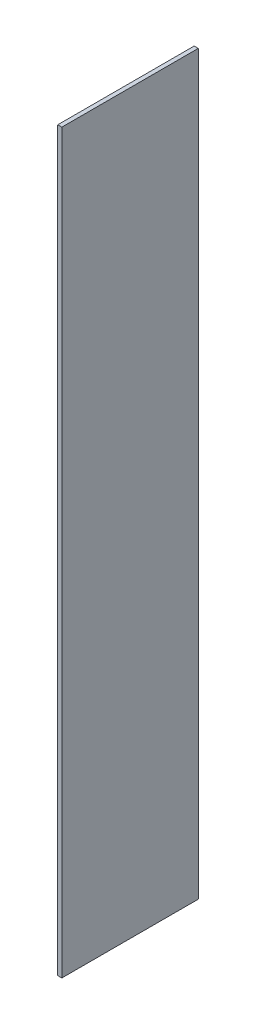
ISO-10303-21;
HEADER;
FILE_DESCRIPTION(('STEP AP214'),'2;1');
FILE_NAME('part.step','',(''),(''),'','','');
FILE_SCHEMA(('AUTOMOTIVE_DESIGN { 1 0 10303 214 1 1 1 1 }'));
ENDSEC;
DATA;
#1=APPLICATION_CONTEXT('core data for automotive mechanical design processes');
#2=APPLICATION_PROTOCOL_DEFINITION('international standard','automotive_design',2000,#1);
#3=PRODUCT_CONTEXT('',#1,'mechanical');
#4=PRODUCT('Part','Part','',(#3));
#5=PRODUCT_RELATED_PRODUCT_CATEGORY('part','',(#4));
#6=PRODUCT_DEFINITION_FORMATION('','',#4);
#7=PRODUCT_DEFINITION_CONTEXT('part definition',#1,'design');
#8=PRODUCT_DEFINITION('design','',#6,#7);
#9=PRODUCT_DEFINITION_SHAPE('','',#8);
#10=(LENGTH_UNIT() NAMED_UNIT(*) SI_UNIT(.MILLI.,.METRE.));
#11=(NAMED_UNIT(*) PLANE_ANGLE_UNIT() SI_UNIT($,.RADIAN.));
#12=(NAMED_UNIT(*) SI_UNIT($,.STERADIAN.) SOLID_ANGLE_UNIT());
#13=UNCERTAINTY_MEASURE_WITH_UNIT(LENGTH_MEASURE(1.E-05),#10,'distance_accuracy_value','');
#14=(GEOMETRIC_REPRESENTATION_CONTEXT(3) GLOBAL_UNCERTAINTY_ASSIGNED_CONTEXT((#13)) GLOBAL_UNIT_ASSIGNED_CONTEXT((#10,
#11,#12)) REPRESENTATION_CONTEXT('',''));
#15=CARTESIAN_POINT('',(0.,0.,0.));
#16=DIRECTION('',(0.,0.,1.));
#17=DIRECTION('',(1.,0.,0.));
#18=AXIS2_PLACEMENT_3D('',#15,#16,#17);
#19=CARTESIAN_POINT('',(0.749999999999997,135.,-25.));
#20=DIRECTION('',(-1.,0.,0.));
#21=DIRECTION('',(0.,0.,1.));
#22=AXIS2_PLACEMENT_3D('',#19,#20,#21);
#23=PLANE('',#22);
#24=DIRECTION('',(0.,0.,-1.));
#25=VECTOR('',#24,1.);
#26=CARTESIAN_POINT('',(0.749999999999997,-135.,-25.));
#27=LINE('',#26,#25);
#28=CARTESIAN_POINT('',(0.750000000000002,-135.,25.));
#29=VERTEX_POINT('',#28);
#30=CARTESIAN_POINT('',(0.749999999999997,-135.,-25.));
#31=VERTEX_POINT('',#30);
#32=EDGE_CURVE('E96',#29,#31,#27,.T.);
#33=ORIENTED_EDGE('',*,*,#32,.T.);
#34=DIRECTION('',(0.,-1.,0.));
#35=VECTOR('',#34,1.);
#36=CARTESIAN_POINT('',(0.749999999999997,135.,-25.));
#37=LINE('',#36,#35);
#38=CARTESIAN_POINT('',(0.749999999999997,135.,-25.));
#39=VERTEX_POINT('',#38);
#40=EDGE_CURVE('E11',#39,#31,#37,.T.);
#41=ORIENTED_EDGE('',*,*,#40,.F.);
#42=DIRECTION('',(0.,0.,-1.));
#43=VECTOR('',#42,1.);
#44=CARTESIAN_POINT('',(0.749999999999997,135.,-25.));
#45=LINE('',#44,#43);
#46=CARTESIAN_POINT('',(0.750000000000002,135.,25.));
#47=VERTEX_POINT('',#46);
#48=EDGE_CURVE('E84',#47,#39,#45,.T.);
#49=ORIENTED_EDGE('',*,*,#48,.F.);
#50=DIRECTION('',(0.,-1.,0.));
#51=VECTOR('',#50,1.);
#52=CARTESIAN_POINT('',(0.750000000000002,135.,25.));
#53=LINE('',#52,#51);
#54=EDGE_CURVE('E92',#47,#29,#53,.T.);
#55=ORIENTED_EDGE('',*,*,#54,.T.);
#56=EDGE_LOOP('',(#33,#41,#49,#55));
#57=FACE_BOUND('',#56,.T.);
#58=ADVANCED_FACE('F33',(#57),#23,.F.);
#59=CARTESIAN_POINT('',(-0.750000000000002,135.,-25.));
#60=DIRECTION('',(0.,0.,1.));
#61=DIRECTION('',(1.,0.,0.));
#62=AXIS2_PLACEMENT_3D('',#59,#60,#61);
#63=PLANE('',#62);
#64=DIRECTION('',(-1.,0.,0.));
#65=VECTOR('',#64,1.);
#66=CARTESIAN_POINT('',(-0.750000000000002,-135.,-25.));
#67=LINE('',#66,#65);
#68=CARTESIAN_POINT('',(-0.750000000000002,-135.,-25.));
#69=VERTEX_POINT('',#68);
#70=EDGE_CURVE('E88',#31,#69,#67,.T.);
#71=ORIENTED_EDGE('',*,*,#70,.T.);
#72=DIRECTION('',(0.,-1.,0.));
#73=VECTOR('',#72,1.);
#74=CARTESIAN_POINT('',(-0.750000000000002,135.,-25.));
#75=LINE('',#74,#73);
#76=CARTESIAN_POINT('',(-0.750000000000002,135.,-25.));
#77=VERTEX_POINT('',#76);
#78=EDGE_CURVE('E41',#77,#69,#75,.T.);
#79=ORIENTED_EDGE('',*,*,#78,.F.);
#80=DIRECTION('',(-1.,0.,0.));
#81=VECTOR('',#80,1.);
#82=CARTESIAN_POINT('',(-0.750000000000002,135.,-25.));
#83=LINE('',#82,#81);
#84=EDGE_CURVE('E79',#39,#77,#83,.T.);
#85=ORIENTED_EDGE('',*,*,#84,.F.);
#86=ORIENTED_EDGE('',*,*,#40,.T.);
#87=EDGE_LOOP('',(#71,#79,#85,#86));
#88=FACE_BOUND('',#87,.T.);
#89=ADVANCED_FACE('F87',(#88),#63,.F.);
#90=CARTESIAN_POINT('',(-0.750000000000002,135.,-25.));
#91=DIRECTION('',(1.,0.,0.));
#92=DIRECTION('',(0.,0.,-1.));
#93=AXIS2_PLACEMENT_3D('',#90,#91,#92);
#94=PLANE('',#93);
#95=DIRECTION('',(0.,0.,1.));
#96=VECTOR('',#95,1.);
#97=CARTESIAN_POINT('',(-0.750000000000002,-135.,-25.));
#98=LINE('',#97,#96);
#99=CARTESIAN_POINT('',(-0.749999999999997,-135.,25.));
#100=VERTEX_POINT('',#99);
#101=EDGE_CURVE('E66',#69,#100,#98,.T.);
#102=ORIENTED_EDGE('',*,*,#101,.T.);
#103=DIRECTION('',(0.,-1.,0.));
#104=VECTOR('',#103,1.);
#105=CARTESIAN_POINT('',(-0.749999999999997,135.,25.));
#106=LINE('',#105,#104);
#107=CARTESIAN_POINT('',(-0.749999999999997,135.,25.));
#108=VERTEX_POINT('',#107);
#109=EDGE_CURVE('E89',#108,#100,#106,.T.);
#110=ORIENTED_EDGE('',*,*,#109,.F.);
#111=DIRECTION('',(0.,0.,1.));
#112=VECTOR('',#111,1.);
#113=CARTESIAN_POINT('',(-0.750000000000002,135.,-25.));
#114=LINE('',#113,#112);
#115=EDGE_CURVE('E82',#77,#108,#114,.T.);
#116=ORIENTED_EDGE('',*,*,#115,.F.);
#117=ORIENTED_EDGE('',*,*,#78,.T.);
#118=EDGE_LOOP('',(#102,#110,#116,#117));
#119=FACE_BOUND('',#118,.T.);
#120=ADVANCED_FACE('F90',(#119),#94,.F.);
#121=CARTESIAN_POINT('',(-0.749999999999997,135.,25.));
#122=DIRECTION('',(0.,0.,-1.));
#123=DIRECTION('',(-1.,0.,0.));
#124=AXIS2_PLACEMENT_3D('',#121,#122,#123);
#125=PLANE('',#124);
#126=DIRECTION('',(1.,0.,0.));
#127=VECTOR('',#126,1.);
#128=CARTESIAN_POINT('',(-0.749999999999997,-135.,25.));
#129=LINE('',#128,#127);
#130=EDGE_CURVE('E72',#100,#29,#129,.T.);
#131=ORIENTED_EDGE('',*,*,#130,.T.);
#132=ORIENTED_EDGE('',*,*,#54,.F.);
#133=DIRECTION('',(1.,0.,0.));
#134=VECTOR('',#133,1.);
#135=CARTESIAN_POINT('',(-0.749999999999997,135.,25.));
#136=LINE('',#135,#134);
#137=EDGE_CURVE('E49',#108,#47,#136,.T.);
#138=ORIENTED_EDGE('',*,*,#137,.F.);
#139=ORIENTED_EDGE('',*,*,#109,.T.);
#140=EDGE_LOOP('',(#131,#132,#138,#139));
#141=FACE_BOUND('',#140,.T.);
#142=ADVANCED_FACE('F103',(#141),#125,.F.);
#143=CARTESIAN_POINT('',(0.,135.,0.));
#144=DIRECTION('',(0.,1.,0.));
#145=DIRECTION('',(0.,0.,1.));
#146=AXIS2_PLACEMENT_3D('',#143,#144,#145);
#147=PLANE('',#146);
#148=ORIENTED_EDGE('',*,*,#48,.T.);
#149=ORIENTED_EDGE('',*,*,#84,.T.);
#150=ORIENTED_EDGE('',*,*,#115,.T.);
#151=ORIENTED_EDGE('',*,*,#137,.T.);
#152=EDGE_LOOP('',(#148,#149,#150,#151));
#153=FACE_BOUND('',#152,.T.);
#154=ADVANCED_FACE('F80',(#153),#147,.T.);
#155=CARTESIAN_POINT('',(0.,-135.,0.));
#156=DIRECTION('',(0.,1.,0.));
#157=DIRECTION('',(0.,0.,1.));
#158=AXIS2_PLACEMENT_3D('',#155,#156,#157);
#159=PLANE('',#158);
#160=ORIENTED_EDGE('',*,*,#32,.F.);
#161=ORIENTED_EDGE('',*,*,#130,.F.);
#162=ORIENTED_EDGE('',*,*,#101,.F.);
#163=ORIENTED_EDGE('',*,*,#70,.F.);
#164=EDGE_LOOP('',(#160,#161,#162,#163));
#165=FACE_BOUND('',#164,.T.);
#166=ADVANCED_FACE('F106',(#165),#159,.F.);
#167=CLOSED_SHELL('',(#58,#89,#120,#142,#154,#166));
#168=MANIFOLD_SOLID_BREP('B2',#167);
#169=ADVANCED_BREP_SHAPE_REPRESENTATION('',(#18,#168),#14);
#170=SHAPE_DEFINITION_REPRESENTATION(#9,#169);
ENDSEC;
END-ISO-10303-21;
